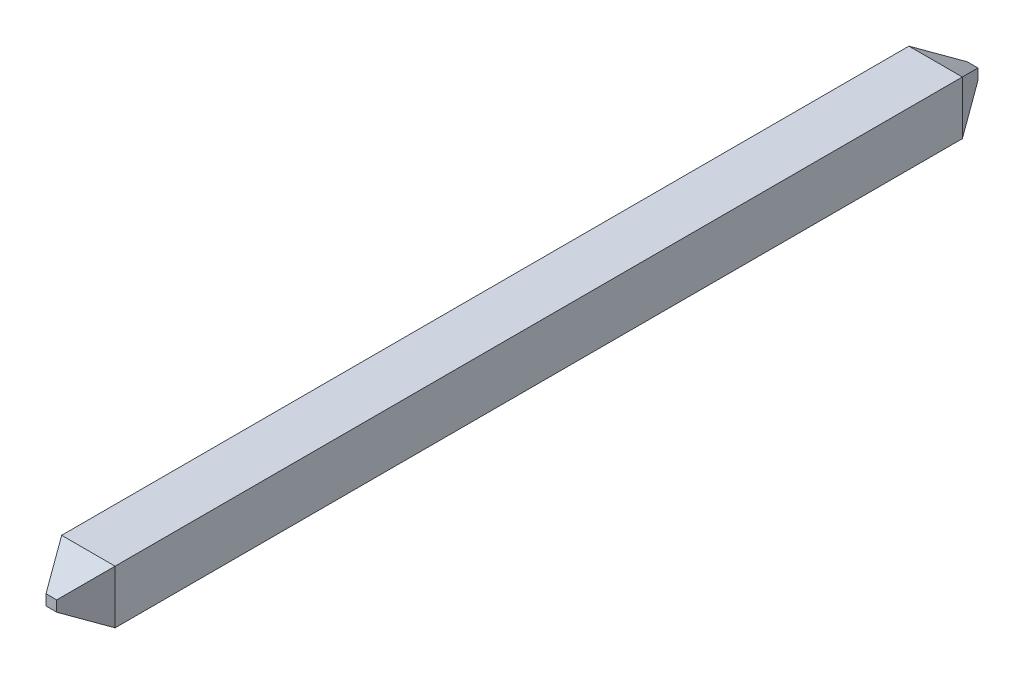
ISO-10303-21;
HEADER;
FILE_DESCRIPTION(('STEP AP214'),'2;1');
FILE_NAME('part.step','',(''),(''),'','','');
FILE_SCHEMA(('AUTOMOTIVE_DESIGN { 1 0 10303 214 1 1 1 1 }'));
ENDSEC;
DATA;
#1=APPLICATION_CONTEXT('core data for automotive mechanical design processes');
#2=APPLICATION_PROTOCOL_DEFINITION('international standard','automotive_design',2000,#1);
#3=PRODUCT_CONTEXT('',#1,'mechanical');
#4=PRODUCT('Part','Part','',(#3));
#5=PRODUCT_RELATED_PRODUCT_CATEGORY('part','',(#4));
#6=PRODUCT_DEFINITION_FORMATION('','',#4);
#7=PRODUCT_DEFINITION_CONTEXT('part definition',#1,'design');
#8=PRODUCT_DEFINITION('design','',#6,#7);
#9=PRODUCT_DEFINITION_SHAPE('','',#8);
#10=(LENGTH_UNIT() NAMED_UNIT(*) SI_UNIT(.MILLI.,.METRE.));
#11=(NAMED_UNIT(*) PLANE_ANGLE_UNIT() SI_UNIT($,.RADIAN.));
#12=(NAMED_UNIT(*) SI_UNIT($,.STERADIAN.) SOLID_ANGLE_UNIT());
#13=UNCERTAINTY_MEASURE_WITH_UNIT(LENGTH_MEASURE(1.E-05),#10,'distance_accuracy_value','');
#14=(GEOMETRIC_REPRESENTATION_CONTEXT(3) GLOBAL_UNCERTAINTY_ASSIGNED_CONTEXT((#13)) GLOBAL_UNIT_ASSIGNED_CONTEXT((#10,
#11,#12)) REPRESENTATION_CONTEXT('',''));
#15=CARTESIAN_POINT('',(0.,0.,0.));
#16=DIRECTION('',(0.,0.,1.));
#17=DIRECTION('',(1.,0.,0.));
#18=AXIS2_PLACEMENT_3D('',#15,#16,#17);
#19=CARTESIAN_POINT('',(-0.2,0.25,0.));
#20=DIRECTION('',(0.866025403784329,0.,-0.50000000000019));
#21=DIRECTION('',(-0.50000000000019,0.,-0.866025403784329));
#22=AXIS2_PLACEMENT_3D('',#19,#20,#21);
#23=PLANE('',#22);
#24=DIRECTION('',(0.447213595499784,-0.447213595500171,0.774596669241461));
#25=VECTOR('',#24,1.);
#26=CARTESIAN_POINT('',(-0.2,-0.05,0.));
#27=LINE('',#26,#25);
#28=CARTESIAN_POINT('',(-0.2,-0.05,0.));
#29=VERTEX_POINT('',#28);
#30=CARTESIAN_POINT('',(0.,-0.250000000000022,0.346410161513938));
#31=VERTEX_POINT('',#30);
#32=EDGE_CURVE('E85',#29,#31,#27,.T.);
#33=ORIENTED_EDGE('',*,*,#32,.F.);
#34=DIRECTION('',(0.,1.,0.));
#35=VECTOR('',#34,1.);
#36=CARTESIAN_POINT('',(-0.2,0.25,0.));
#37=LINE('',#36,#35);
#38=CARTESIAN_POINT('',(-0.2,0.0499999999999567,0.));
#39=VERTEX_POINT('',#38);
#40=EDGE_CURVE('E20',#39,#29,#37,.F.);
#41=ORIENTED_EDGE('',*,*,#40,.F.);
#42=DIRECTION('',(0.447213595499784,0.447213595500171,0.774596669241461));
#43=VECTOR('',#42,1.);
#44=CARTESIAN_POINT('',(-0.2,0.0499999999998268,0.));
#45=LINE('',#44,#43);
#46=CARTESIAN_POINT('',(0.,0.25,0.34641016151395));
#47=VERTEX_POINT('',#46);
#48=EDGE_CURVE('E82',#39,#47,#45,.T.);
#49=ORIENTED_EDGE('',*,*,#48,.T.);
#50=DIRECTION('',(0.,1.,0.));
#51=VECTOR('',#50,1.);
#52=CARTESIAN_POINT('',(0.,0.25,0.346410161514));
#53=LINE('',#52,#51);
#54=EDGE_CURVE('E101',#47,#31,#53,.F.);
#55=ORIENTED_EDGE('',*,*,#54,.T.);
#56=EDGE_LOOP('',(#33,#41,#49,#55));
#57=FACE_BOUND('',#56,.T.);
#58=ADVANCED_FACE('F17',(#57),#23,.T.);
#59=CARTESIAN_POINT('',(0.,0.25,8.273589838486));
#60=DIRECTION('',(-0.866025403784329,0.,-0.50000000000019));
#61=DIRECTION('',(-0.50000000000019,0.,0.866025403784329));
#62=AXIS2_PLACEMENT_3D('',#59,#60,#61);
#63=PLANE('',#62);
#64=DIRECTION('',(0.,1.,0.));
#65=VECTOR('',#64,1.);
#66=CARTESIAN_POINT('',(0.,0.25,8.273589838486));
#67=LINE('',#66,#65);
#68=CARTESIAN_POINT('',(0.,-0.25,8.273589838486));
#69=VERTEX_POINT('',#68);
#70=CARTESIAN_POINT('',(0.,0.250000000000022,8.27358983848601));
#71=VERTEX_POINT('',#70);
#72=EDGE_CURVE('E99',#69,#71,#67,.T.);
#73=ORIENTED_EDGE('',*,*,#72,.T.);
#74=DIRECTION('',(0.447213595499784,0.447213595500171,-0.77459666924146));
#75=VECTOR('',#74,1.);
#76=CARTESIAN_POINT('',(-0.2,0.05,8.62));
#77=LINE('',#76,#75);
#78=CARTESIAN_POINT('',(-0.200000000000086,0.05,8.61999999999995));
#79=VERTEX_POINT('',#78);
#80=EDGE_CURVE('E108',#79,#71,#77,.T.);
#81=ORIENTED_EDGE('',*,*,#80,.F.);
#82=DIRECTION('',(0.,1.,0.));
#83=VECTOR('',#82,1.);
#84=CARTESIAN_POINT('',(-0.2,0.25,8.62));
#85=LINE('',#84,#83);
#86=CARTESIAN_POINT('',(-0.200000000000086,-0.0499999999999568,8.61999999999993));
#87=VERTEX_POINT('',#86);
#88=EDGE_CURVE('E113',#79,#87,#85,.F.);
#89=ORIENTED_EDGE('',*,*,#88,.T.);
#90=DIRECTION('',(0.447213595499784,-0.447213595500171,-0.77459666924146));
#91=VECTOR('',#90,1.);
#92=CARTESIAN_POINT('',(-0.2,-0.0499999999998271,8.6199999999999));
#93=LINE('',#92,#91);
#94=EDGE_CURVE('E111',#87,#69,#93,.T.);
#95=ORIENTED_EDGE('',*,*,#94,.T.);
#96=EDGE_LOOP('',(#73,#81,#89,#95));
#97=FACE_BOUND('',#96,.T.);
#98=ADVANCED_FACE('F176',(#97),#63,.F.);
#99=CARTESIAN_POINT('',(0.,0.25,0.));
#100=DIRECTION('',(0.,0.,-1.));
#101=DIRECTION('',(-1.,0.,0.));
#102=AXIS2_PLACEMENT_3D('',#99,#100,#101);
#103=PLANE('',#102);
#104=ORIENTED_EDGE('',*,*,#40,.T.);
#105=DIRECTION('',(1.,0.,0.));
#106=VECTOR('',#105,1.);
#107=CARTESIAN_POINT('',(0.,-0.05,0.));
#108=LINE('',#107,#106);
#109=CARTESIAN_POINT('',(-0.299999999999957,-0.0500000000000001,0.));
#110=VERTEX_POINT('',#109);
#111=EDGE_CURVE('E105',#110,#29,#108,.T.);
#112=ORIENTED_EDGE('',*,*,#111,.F.);
#113=DIRECTION('',(0.,1.,0.));
#114=VECTOR('',#113,1.);
#115=CARTESIAN_POINT('',(-0.299999999999827,0.25,0.));
#116=LINE('',#115,#114);
#117=CARTESIAN_POINT('',(-0.299999999999957,0.0499999999999567,0.));
#118=VERTEX_POINT('',#117);
#119=EDGE_CURVE('E91',#110,#118,#116,.T.);
#120=ORIENTED_EDGE('',*,*,#119,.T.);
#121=DIRECTION('',(1.,0.,0.));
#122=VECTOR('',#121,1.);
#123=CARTESIAN_POINT('',(0.,0.0499999999998268,0.));
#124=LINE('',#123,#122);
#125=EDGE_CURVE('E87',#118,#39,#124,.T.);
#126=ORIENTED_EDGE('',*,*,#125,.T.);
#127=EDGE_LOOP('',(#104,#112,#120,#126));
#128=FACE_BOUND('',#127,.T.);
#129=ADVANCED_FACE('F89',(#128),#103,.T.);
#130=CARTESIAN_POINT('',(0.,0.25,0.346410161514));
#131=DIRECTION('',(0.,-0.866025403784329,0.50000000000019));
#132=DIRECTION('',(0.,-0.50000000000019,-0.866025403784329));
#133=AXIS2_PLACEMENT_3D('',#130,#131,#132);
#134=PLANE('',#133);
#135=DIRECTION('',(1.,0.,0.));
#136=VECTOR('',#135,1.);
#137=CARTESIAN_POINT('',(0.,0.25,0.346410161514));
#138=LINE('',#137,#136);
#139=CARTESIAN_POINT('',(-0.5,0.25,0.346410161514));
#140=VERTEX_POINT('',#139);
#141=EDGE_CURVE('E97',#47,#140,#138,.F.);
#142=ORIENTED_EDGE('',*,*,#141,.F.);
#143=ORIENTED_EDGE('',*,*,#48,.F.);
#144=ORIENTED_EDGE('',*,*,#125,.F.);
#145=DIRECTION('',(-0.447213595500171,0.447213595499784,0.774596669241461));
#146=VECTOR('',#145,1.);
#147=CARTESIAN_POINT('',(-0.299999999999827,0.05,0.));
#148=LINE('',#147,#146);
#149=EDGE_CURVE('E127',#118,#140,#148,.T.);
#150=ORIENTED_EDGE('',*,*,#149,.T.);
#151=EDGE_LOOP('',(#142,#143,#144,#150));
#152=FACE_BOUND('',#151,.T.);
#153=ADVANCED_FACE('F95',(#152),#134,.F.);
#154=CARTESIAN_POINT('',(0.,0.25,8.62));
#155=DIRECTION('',(-1.,0.,0.));
#156=DIRECTION('',(0.,0.,1.));
#157=AXIS2_PLACEMENT_3D('',#154,#155,#156);
#158=PLANE('',#157);
#159=ORIENTED_EDGE('',*,*,#54,.F.);
#160=DIRECTION('',(0.,0.,1.));
#161=VECTOR('',#160,1.);
#162=CARTESIAN_POINT('',(0.,0.25,8.62));
#163=LINE('',#162,#161);
#164=EDGE_CURVE('E120',#71,#47,#163,.F.);
#165=ORIENTED_EDGE('',*,*,#164,.F.);
#166=ORIENTED_EDGE('',*,*,#72,.F.);
#167=DIRECTION('',(0.,0.,1.));
#168=VECTOR('',#167,1.);
#169=CARTESIAN_POINT('',(0.,-0.25,8.62));
#170=LINE('',#169,#168);
#171=EDGE_CURVE('E134',#69,#31,#170,.F.);
#172=ORIENTED_EDGE('',*,*,#171,.T.);
#173=EDGE_LOOP('',(#159,#165,#166,#172));
#174=FACE_BOUND('',#173,.T.);
#175=ADVANCED_FACE('F210',(#174),#158,.F.);
#176=CARTESIAN_POINT('',(0.,-0.05,0.));
#177=DIRECTION('',(0.,-0.866025403784329,-0.50000000000019));
#178=DIRECTION('',(0.,0.50000000000019,-0.866025403784329));
#179=AXIS2_PLACEMENT_3D('',#176,#177,#178);
#180=PLANE('',#179);
#181=ORIENTED_EDGE('',*,*,#32,.T.);
#182=DIRECTION('',(1.,0.,0.));
#183=VECTOR('',#182,1.);
#184=CARTESIAN_POINT('',(0.,-0.25,0.346410161514));
#185=LINE('',#184,#183);
#186=CARTESIAN_POINT('',(-0.5,-0.250000000000087,0.34641016151395));
#187=VERTEX_POINT('',#186);
#188=EDGE_CURVE('E137',#31,#187,#185,.F.);
#189=ORIENTED_EDGE('',*,*,#188,.T.);
#190=DIRECTION('',(0.447213595500171,0.447213595499784,-0.774596669241461));
#191=VECTOR('',#190,1.);
#192=CARTESIAN_POINT('',(-0.5,-0.25,0.346410161514));
#193=LINE('',#192,#191);
#194=EDGE_CURVE('E129',#187,#110,#193,.T.);
#195=ORIENTED_EDGE('',*,*,#194,.T.);
#196=ORIENTED_EDGE('',*,*,#111,.T.);
#197=EDGE_LOOP('',(#181,#189,#195,#196));
#198=FACE_BOUND('',#197,.T.);
#199=ADVANCED_FACE('F187',(#198),#180,.T.);
#200=CARTESIAN_POINT('',(0.,0.05,8.62));
#201=DIRECTION('',(0.,0.866025403784329,0.50000000000019));
#202=DIRECTION('',(0.,-0.50000000000019,0.866025403784329));
#203=AXIS2_PLACEMENT_3D('',#200,#201,#202);
#204=PLANE('',#203);
#205=DIRECTION('',(-0.447213595500171,0.447213595499784,-0.77459666924146));
#206=VECTOR('',#205,1.);
#207=CARTESIAN_POINT('',(-0.3,0.05,8.62));
#208=LINE('',#207,#206);
#209=CARTESIAN_POINT('',(-0.3,0.05,8.62));
#210=VERTEX_POINT('',#209);
#211=CARTESIAN_POINT('',(-0.500000000000022,0.250000000000086,8.27358983848606));
#212=VERTEX_POINT('',#211);
#213=EDGE_CURVE('E139',#210,#212,#208,.T.);
#214=ORIENTED_EDGE('',*,*,#213,.F.);
#215=DIRECTION('',(-1.,0.,0.));
#216=VECTOR('',#215,1.);
#217=CARTESIAN_POINT('',(0.,0.05,8.62));
#218=LINE('',#217,#216);
#219=EDGE_CURVE('E117',#210,#79,#218,.F.);
#220=ORIENTED_EDGE('',*,*,#219,.T.);
#221=ORIENTED_EDGE('',*,*,#80,.T.);
#222=DIRECTION('',(1.,0.,0.));
#223=VECTOR('',#222,1.);
#224=CARTESIAN_POINT('',(0.,0.25,8.273589838486));
#225=LINE('',#224,#223);
#226=EDGE_CURVE('E123',#212,#71,#225,.T.);
#227=ORIENTED_EDGE('',*,*,#226,.F.);
#228=EDGE_LOOP('',(#214,#220,#221,#227));
#229=FACE_BOUND('',#228,.T.);
#230=ADVANCED_FACE('F169',(#229),#204,.T.);
#231=CARTESIAN_POINT('',(0.,-0.25,8.273589838486));
#232=DIRECTION('',(0.,0.866025403784329,-0.50000000000019));
#233=DIRECTION('',(0.,0.50000000000019,0.866025403784329));
#234=AXIS2_PLACEMENT_3D('',#231,#232,#233);
#235=PLANE('',#234);
#236=DIRECTION('',(-1.,0.,0.));
#237=VECTOR('',#236,1.);
#238=CARTESIAN_POINT('',(0.,-0.05,8.62));
#239=LINE('',#238,#237);
#240=CARTESIAN_POINT('',(-0.3,-0.0499999999999136,8.61999999999995));
#241=VERTEX_POINT('',#240);
#242=EDGE_CURVE('E115',#87,#241,#239,.T.);
#243=ORIENTED_EDGE('',*,*,#242,.T.);
#244=DIRECTION('',(0.447213595500171,0.447213595499784,0.77459666924146));
#245=VECTOR('',#244,1.);
#246=CARTESIAN_POINT('',(-0.500000000000173,-0.25,8.2735898384861));
#247=LINE('',#246,#245);
#248=CARTESIAN_POINT('',(-0.500000000000022,-0.25,8.27358983848601));
#249=VERTEX_POINT('',#248);
#250=EDGE_CURVE('E35',#249,#241,#247,.T.);
#251=ORIENTED_EDGE('',*,*,#250,.F.);
#252=DIRECTION('',(1.,0.,0.));
#253=VECTOR('',#252,1.);
#254=CARTESIAN_POINT('',(0.,-0.25,8.273589838486));
#255=LINE('',#254,#253);
#256=EDGE_CURVE('E132',#249,#69,#255,.T.);
#257=ORIENTED_EDGE('',*,*,#256,.T.);
#258=ORIENTED_EDGE('',*,*,#94,.F.);
#259=EDGE_LOOP('',(#243,#251,#257,#258));
#260=FACE_BOUND('',#259,.T.);
#261=ADVANCED_FACE('F177',(#260),#235,.F.);
#262=CARTESIAN_POINT('',(0.,0.25,8.62));
#263=DIRECTION('',(0.,0.,-1.));
#264=DIRECTION('',(-1.,0.,0.));
#265=AXIS2_PLACEMENT_3D('',#262,#263,#264);
#266=PLANE('',#265);
#267=DIRECTION('',(0.,1.,0.));
#268=VECTOR('',#267,1.);
#269=CARTESIAN_POINT('',(-0.3,0.25,8.62));
#270=LINE('',#269,#268);
#271=EDGE_CURVE('E143',#241,#210,#270,.T.);
#272=ORIENTED_EDGE('',*,*,#271,.F.);
#273=ORIENTED_EDGE('',*,*,#242,.F.);
#274=ORIENTED_EDGE('',*,*,#88,.F.);
#275=ORIENTED_EDGE('',*,*,#219,.F.);
#276=EDGE_LOOP('',(#272,#273,#274,#275));
#277=FACE_BOUND('',#276,.T.);
#278=ADVANCED_FACE('F173',(#277),#266,.F.);
#279=CARTESIAN_POINT('',(0.,0.25,8.62));
#280=DIRECTION('',(0.,1.,0.));
#281=DIRECTION('',(0.,0.,1.));
#282=AXIS2_PLACEMENT_3D('',#279,#280,#281);
#283=PLANE('',#282);
#284=DIRECTION('',(0.,0.,1.));
#285=VECTOR('',#284,1.);
#286=CARTESIAN_POINT('',(-0.5,0.25,8.62));
#287=LINE('',#286,#285);
#288=EDGE_CURVE('E146',#212,#140,#287,.F.);
#289=ORIENTED_EDGE('',*,*,#288,.F.);
#290=ORIENTED_EDGE('',*,*,#226,.T.);
#291=ORIENTED_EDGE('',*,*,#164,.T.);
#292=ORIENTED_EDGE('',*,*,#141,.T.);
#293=EDGE_LOOP('',(#289,#290,#291,#292));
#294=FACE_BOUND('',#293,.T.);
#295=ADVANCED_FACE('F185',(#294),#283,.T.);
#296=CARTESIAN_POINT('',(-0.5,0.25,0.346410161514));
#297=DIRECTION('',(0.866025403784329,0.,0.50000000000019));
#298=DIRECTION('',(0.50000000000019,0.,-0.866025403784329));
#299=AXIS2_PLACEMENT_3D('',#296,#297,#298);
#300=PLANE('',#299);
#301=DIRECTION('',(0.,1.,0.));
#302=VECTOR('',#301,1.);
#303=CARTESIAN_POINT('',(-0.5,0.25,0.346410161514));
#304=LINE('',#303,#302);
#305=EDGE_CURVE('E149',#140,#187,#304,.F.);
#306=ORIENTED_EDGE('',*,*,#305,.F.);
#307=ORIENTED_EDGE('',*,*,#149,.F.);
#308=ORIENTED_EDGE('',*,*,#119,.F.);
#309=ORIENTED_EDGE('',*,*,#194,.F.);
#310=EDGE_LOOP('',(#306,#307,#308,#309));
#311=FACE_BOUND('',#310,.T.);
#312=ADVANCED_FACE('F198',(#311),#300,.F.);
#313=CARTESIAN_POINT('',(0.,-0.25,8.62));
#314=DIRECTION('',(0.,1.,0.));
#315=DIRECTION('',(0.,0.,1.));
#316=AXIS2_PLACEMENT_3D('',#313,#314,#315);
#317=PLANE('',#316);
#318=ORIENTED_EDGE('',*,*,#188,.F.);
#319=ORIENTED_EDGE('',*,*,#171,.F.);
#320=ORIENTED_EDGE('',*,*,#256,.F.);
#321=DIRECTION('',(0.,0.,1.));
#322=VECTOR('',#321,1.);
#323=CARTESIAN_POINT('',(-0.5,-0.25,8.62));
#324=LINE('',#323,#322);
#325=EDGE_CURVE('E26',#187,#249,#324,.T.);
#326=ORIENTED_EDGE('',*,*,#325,.F.);
#327=EDGE_LOOP('',(#318,#319,#320,#326));
#328=FACE_BOUND('',#327,.T.);
#329=ADVANCED_FACE('F160',(#328),#317,.F.);
#330=CARTESIAN_POINT('',(-0.3,0.25,8.62));
#331=DIRECTION('',(-0.866025403784329,0.,0.50000000000019));
#332=DIRECTION('',(0.50000000000019,0.,0.866025403784329));
#333=AXIS2_PLACEMENT_3D('',#330,#331,#332);
#334=PLANE('',#333);
#335=ORIENTED_EDGE('',*,*,#250,.T.);
#336=ORIENTED_EDGE('',*,*,#271,.T.);
#337=ORIENTED_EDGE('',*,*,#213,.T.);
#338=DIRECTION('',(0.,1.,0.));
#339=VECTOR('',#338,1.);
#340=CARTESIAN_POINT('',(-0.5,0.25,8.273589838486));
#341=LINE('',#340,#339);
#342=EDGE_CURVE('E11',#249,#212,#341,.T.);
#343=ORIENTED_EDGE('',*,*,#342,.F.);
#344=EDGE_LOOP('',(#335,#336,#337,#343));
#345=FACE_BOUND('',#344,.T.);
#346=ADVANCED_FACE('F165',(#345),#334,.T.);
#347=CARTESIAN_POINT('',(-0.5,0.25,8.62));
#348=DIRECTION('',(-1.,0.,0.));
#349=DIRECTION('',(0.,0.,1.));
#350=AXIS2_PLACEMENT_3D('',#347,#348,#349);
#351=PLANE('',#350);
#352=ORIENTED_EDGE('',*,*,#325,.T.);
#353=ORIENTED_EDGE('',*,*,#342,.T.);
#354=ORIENTED_EDGE('',*,*,#288,.T.);
#355=ORIENTED_EDGE('',*,*,#305,.T.);
#356=EDGE_LOOP('',(#352,#353,#354,#355));
#357=FACE_BOUND('',#356,.T.);
#358=ADVANCED_FACE('F155',(#357),#351,.T.);
#359=CLOSED_SHELL('',(#58,#98,#129,#153,#175,#199,#230,#261,#278,#295,#312,#329,#346,#358));
#360=MANIFOLD_SOLID_BREP('B1',#359);
#361=ADVANCED_BREP_SHAPE_REPRESENTATION('',(#18,#360),#14);
#362=SHAPE_DEFINITION_REPRESENTATION(#9,#361);
ENDSEC;
END-ISO-10303-21;
